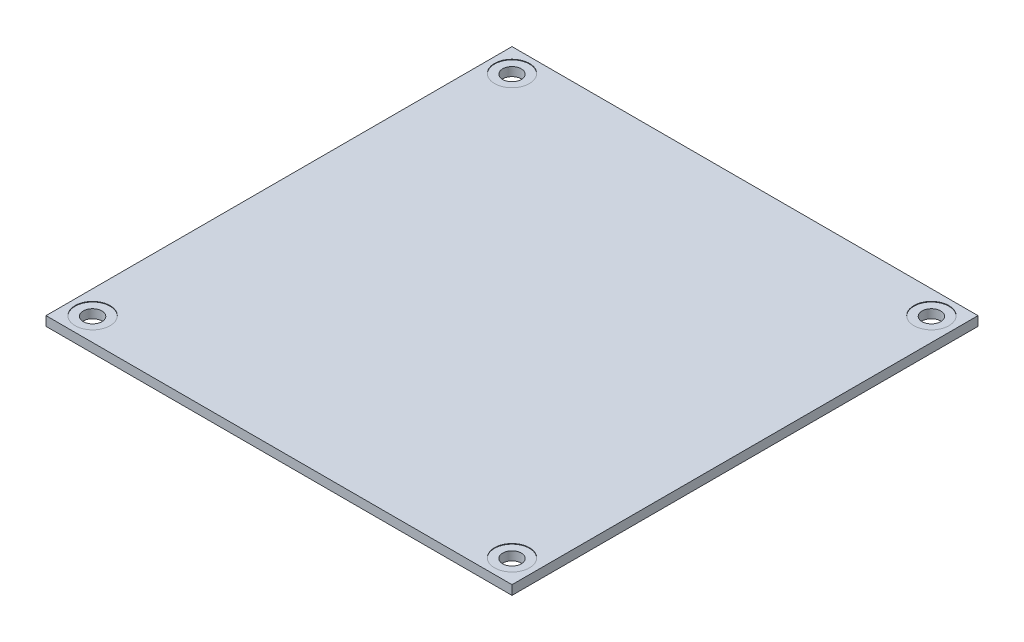
ISO-10303-21;
HEADER;
FILE_DESCRIPTION(('STEP AP214'),'2;1');
FILE_NAME('part.step','',(''),(''),'','','');
FILE_SCHEMA(('AUTOMOTIVE_DESIGN { 1 0 10303 214 1 1 1 1 }'));
ENDSEC;
DATA;
#1=APPLICATION_CONTEXT('core data for automotive mechanical design processes');
#2=APPLICATION_PROTOCOL_DEFINITION('international standard','automotive_design',2000,#1);
#3=PRODUCT_CONTEXT('',#1,'mechanical');
#4=PRODUCT('Part','Part','',(#3));
#5=PRODUCT_RELATED_PRODUCT_CATEGORY('part','',(#4));
#6=PRODUCT_DEFINITION_FORMATION('','',#4);
#7=PRODUCT_DEFINITION_CONTEXT('part definition',#1,'design');
#8=PRODUCT_DEFINITION('design','',#6,#7);
#9=PRODUCT_DEFINITION_SHAPE('','',#8);
#10=(LENGTH_UNIT() NAMED_UNIT(*) SI_UNIT(.MILLI.,.METRE.));
#11=(NAMED_UNIT(*) PLANE_ANGLE_UNIT() SI_UNIT($,.RADIAN.));
#12=(NAMED_UNIT(*) SI_UNIT($,.STERADIAN.) SOLID_ANGLE_UNIT());
#13=UNCERTAINTY_MEASURE_WITH_UNIT(LENGTH_MEASURE(1.E-05),#10,'distance_accuracy_value','');
#14=(GEOMETRIC_REPRESENTATION_CONTEXT(3) GLOBAL_UNCERTAINTY_ASSIGNED_CONTEXT((#13)) GLOBAL_UNIT_ASSIGNED_CONTEXT((#10,
#11,#12)) REPRESENTATION_CONTEXT('',''));
#15=CARTESIAN_POINT('',(0.,0.,0.));
#16=DIRECTION('',(0.,0.,1.));
#17=DIRECTION('',(1.,0.,0.));
#18=AXIS2_PLACEMENT_3D('',#15,#16,#17);
#19=CARTESIAN_POINT('',(-40.,1.6,-40.));
#20=DIRECTION('',(1.,0.,0.));
#21=DIRECTION('',(0.,0.,-1.));
#22=AXIS2_PLACEMENT_3D('',#19,#20,#21);
#23=PLANE('',#22);
#24=DIRECTION('',(0.,0.,1.));
#25=VECTOR('',#24,1.);
#26=CARTESIAN_POINT('',(-40.,0.,-40.));
#27=LINE('',#26,#25);
#28=CARTESIAN_POINT('',(-40.,0.,-40.));
#29=VERTEX_POINT('',#28);
#30=CARTESIAN_POINT('',(-40.,0.,40.));
#31=VERTEX_POINT('',#30);
#32=EDGE_CURVE('E98',#29,#31,#27,.T.);
#33=ORIENTED_EDGE('',*,*,#32,.T.);
#34=DIRECTION('',(0.,-1.,0.));
#35=VECTOR('',#34,1.);
#36=CARTESIAN_POINT('',(-40.,1.6,40.));
#37=LINE('',#36,#35);
#38=CARTESIAN_POINT('',(-40.,1.6,40.));
#39=VERTEX_POINT('',#38);
#40=EDGE_CURVE('E11',#39,#31,#37,.T.);
#41=ORIENTED_EDGE('',*,*,#40,.F.);
#42=DIRECTION('',(0.,0.,1.));
#43=VECTOR('',#42,1.);
#44=CARTESIAN_POINT('',(-40.,1.6,-40.));
#45=LINE('',#44,#43);
#46=CARTESIAN_POINT('',(-40.,1.6,-40.));
#47=VERTEX_POINT('',#46);
#48=EDGE_CURVE('E83',#47,#39,#45,.T.);
#49=ORIENTED_EDGE('',*,*,#48,.F.);
#50=DIRECTION('',(0.,-1.,0.));
#51=VECTOR('',#50,1.);
#52=CARTESIAN_POINT('',(-40.,1.6,-40.));
#53=LINE('',#52,#51);
#54=EDGE_CURVE('E50',#47,#29,#53,.T.);
#55=ORIENTED_EDGE('',*,*,#54,.T.);
#56=EDGE_LOOP('',(#33,#41,#49,#55));
#57=FACE_BOUND('',#56,.T.);
#58=ADVANCED_FACE('F32',(#57),#23,.F.);
#59=CARTESIAN_POINT('',(-40.,1.6,40.));
#60=DIRECTION('',(0.,0.,-1.));
#61=DIRECTION('',(-1.,0.,0.));
#62=AXIS2_PLACEMENT_3D('',#59,#60,#61);
#63=PLANE('',#62);
#64=DIRECTION('',(1.,0.,0.));
#65=VECTOR('',#64,1.);
#66=CARTESIAN_POINT('',(-40.,0.,40.));
#67=LINE('',#66,#65);
#68=CARTESIAN_POINT('',(40.,0.,40.));
#69=VERTEX_POINT('',#68);
#70=EDGE_CURVE('E88',#31,#69,#67,.T.);
#71=ORIENTED_EDGE('',*,*,#70,.T.);
#72=DIRECTION('',(0.,-1.,0.));
#73=VECTOR('',#72,1.);
#74=CARTESIAN_POINT('',(40.,1.6,40.));
#75=LINE('',#74,#73);
#76=CARTESIAN_POINT('',(40.,1.6,40.));
#77=VERTEX_POINT('',#76);
#78=EDGE_CURVE('E41',#77,#69,#75,.T.);
#79=ORIENTED_EDGE('',*,*,#78,.F.);
#80=DIRECTION('',(1.,0.,0.));
#81=VECTOR('',#80,1.);
#82=CARTESIAN_POINT('',(-40.,1.6,40.));
#83=LINE('',#82,#81);
#84=EDGE_CURVE('E75',#39,#77,#83,.T.);
#85=ORIENTED_EDGE('',*,*,#84,.F.);
#86=ORIENTED_EDGE('',*,*,#40,.T.);
#87=EDGE_LOOP('',(#71,#79,#85,#86));
#88=FACE_BOUND('',#87,.T.);
#89=ADVANCED_FACE('F87',(#88),#63,.F.);
#90=CARTESIAN_POINT('',(40.,1.6,-40.));
#91=DIRECTION('',(1.,0.,0.));
#92=DIRECTION('',(0.,0.,-1.));
#93=AXIS2_PLACEMENT_3D('',#90,#91,#92);
#94=PLANE('',#93);
#95=DIRECTION('',(0.,0.,1.));
#96=VECTOR('',#95,1.);
#97=CARTESIAN_POINT('',(40.,0.,-40.));
#98=LINE('',#97,#96);
#99=CARTESIAN_POINT('',(40.,0.,-40.));
#100=VERTEX_POINT('',#99);
#101=EDGE_CURVE('E102',#100,#69,#98,.T.);
#102=ORIENTED_EDGE('',*,*,#101,.F.);
#103=DIRECTION('',(0.,-1.,0.));
#104=VECTOR('',#103,1.);
#105=CARTESIAN_POINT('',(40.,1.6,-40.));
#106=LINE('',#105,#104);
#107=CARTESIAN_POINT('',(40.,1.6,-40.));
#108=VERTEX_POINT('',#107);
#109=EDGE_CURVE('E64',#108,#100,#106,.T.);
#110=ORIENTED_EDGE('',*,*,#109,.F.);
#111=DIRECTION('',(0.,0.,1.));
#112=VECTOR('',#111,1.);
#113=CARTESIAN_POINT('',(40.,1.6,-40.));
#114=LINE('',#113,#112);
#115=EDGE_CURVE('E82',#108,#77,#114,.T.);
#116=ORIENTED_EDGE('',*,*,#115,.T.);
#117=ORIENTED_EDGE('',*,*,#78,.T.);
#118=EDGE_LOOP('',(#102,#110,#116,#117));
#119=FACE_BOUND('',#118,.T.);
#120=ADVANCED_FACE('F92',(#119),#94,.T.);
#121=CARTESIAN_POINT('',(-40.,1.6,-40.));
#122=DIRECTION('',(0.,0.,-1.));
#123=DIRECTION('',(-1.,0.,0.));
#124=AXIS2_PLACEMENT_3D('',#121,#122,#123);
#125=PLANE('',#124);
#126=DIRECTION('',(1.,0.,0.));
#127=VECTOR('',#126,1.);
#128=CARTESIAN_POINT('',(-40.,0.,-40.));
#129=LINE('',#128,#127);
#130=EDGE_CURVE('E104',#29,#100,#129,.T.);
#131=ORIENTED_EDGE('',*,*,#130,.F.);
#132=ORIENTED_EDGE('',*,*,#54,.F.);
#133=DIRECTION('',(1.,0.,0.));
#134=VECTOR('',#133,1.);
#135=CARTESIAN_POINT('',(-40.,1.6,-40.));
#136=LINE('',#135,#134);
#137=EDGE_CURVE('E93',#47,#108,#136,.T.);
#138=ORIENTED_EDGE('',*,*,#137,.T.);
#139=ORIENTED_EDGE('',*,*,#109,.T.);
#140=EDGE_LOOP('',(#131,#132,#138,#139));
#141=FACE_BOUND('',#140,.T.);
#142=ADVANCED_FACE('F159',(#141),#125,.T.);
#143=CARTESIAN_POINT('',(0.,1.6,0.));
#144=DIRECTION('',(0.,1.,0.));
#145=DIRECTION('',(0.,0.,1.));
#146=AXIS2_PLACEMENT_3D('',#143,#144,#145);
#147=PLANE('',#146);
#148=CARTESIAN_POINT('',(36.,1.6,-36.));
#149=DIRECTION('',(0.,1.,0.));
#150=DIRECTION('',(0.,0.,-1.));
#151=AXIS2_PLACEMENT_3D('',#148,#149,#150);
#152=CIRCLE('',#151,3.);
#153=CARTESIAN_POINT('',(36.,1.6,-39.));
#154=VERTEX_POINT('',#153);
#155=EDGE_CURVE('E136',#154,#154,#152,.T.);
#156=ORIENTED_EDGE('',*,*,#155,.F.);
#157=EDGE_LOOP('',(#156));
#158=FACE_BOUND('',#157,.T.);
#159=CARTESIAN_POINT('',(36.,1.6,36.));
#160=DIRECTION('',(0.,1.,0.));
#161=DIRECTION('',(0.,0.,1.));
#162=AXIS2_PLACEMENT_3D('',#159,#160,#161);
#163=CIRCLE('',#162,3.);
#164=CARTESIAN_POINT('',(36.,1.6,39.));
#165=VERTEX_POINT('',#164);
#166=EDGE_CURVE('E142',#165,#165,#163,.T.);
#167=ORIENTED_EDGE('',*,*,#166,.F.);
#168=EDGE_LOOP('',(#167));
#169=FACE_BOUND('',#168,.T.);
#170=CARTESIAN_POINT('',(-36.,1.6,36.));
#171=DIRECTION('',(0.,1.,0.));
#172=DIRECTION('',(0.,0.,-1.));
#173=AXIS2_PLACEMENT_3D('',#170,#171,#172);
#174=CIRCLE('',#173,3.);
#175=CARTESIAN_POINT('',(-36.,1.6,33.));
#176=VERTEX_POINT('',#175);
#177=EDGE_CURVE('E112',#176,#176,#174,.T.);
#178=ORIENTED_EDGE('',*,*,#177,.F.);
#179=EDGE_LOOP('',(#178));
#180=FACE_BOUND('',#179,.T.);
#181=CARTESIAN_POINT('',(-36.,1.6,-36.));
#182=DIRECTION('',(0.,1.,0.));
#183=DIRECTION('',(0.,0.,1.));
#184=AXIS2_PLACEMENT_3D('',#181,#182,#183);
#185=CIRCLE('',#184,3.);
#186=CARTESIAN_POINT('',(-36.,1.6,-33.));
#187=VERTEX_POINT('',#186);
#188=EDGE_CURVE('E135',#187,#187,#185,.T.);
#189=ORIENTED_EDGE('',*,*,#188,.F.);
#190=EDGE_LOOP('',(#189));
#191=FACE_BOUND('',#190,.T.);
#192=ORIENTED_EDGE('',*,*,#48,.T.);
#193=ORIENTED_EDGE('',*,*,#84,.T.);
#194=ORIENTED_EDGE('',*,*,#115,.F.);
#195=ORIENTED_EDGE('',*,*,#137,.F.);
#196=EDGE_LOOP('',(#192,#193,#194,#195));
#197=FACE_BOUND('',#196,.T.);
#198=ADVANCED_FACE('F79',(#158,#169,#180,#191,#197),#147,.T.);
#199=CARTESIAN_POINT('',(0.,0.,0.));
#200=DIRECTION('',(0.,1.,0.));
#201=DIRECTION('',(0.,0.,1.));
#202=AXIS2_PLACEMENT_3D('',#199,#200,#201);
#203=PLANE('',#202);
#204=CARTESIAN_POINT('',(36.,0.,-36.000000000002));
#205=DIRECTION('',(0.,1.,0.));
#206=DIRECTION('',(0.,0.,1.));
#207=AXIS2_PLACEMENT_3D('',#204,#205,#206);
#208=CIRCLE('',#207,1.60000000000209);
#209=CARTESIAN_POINT('',(36.,0.,-34.3999999999999));
#210=VERTEX_POINT('',#209);
#211=EDGE_CURVE('E117',#210,#210,#208,.T.);
#212=ORIENTED_EDGE('',*,*,#211,.T.);
#213=EDGE_LOOP('',(#212));
#214=FACE_BOUND('',#213,.T.);
#215=CARTESIAN_POINT('',(36.000000000002,0.,35.999999999998));
#216=DIRECTION('',(0.,1.,0.));
#217=DIRECTION('',(0.,0.,1.));
#218=AXIS2_PLACEMENT_3D('',#215,#216,#217);
#219=CIRCLE('',#218,1.6);
#220=CARTESIAN_POINT('',(36.000000000002,0.,37.599999999998));
#221=VERTEX_POINT('',#220);
#222=EDGE_CURVE('E321',#221,#221,#219,.T.);
#223=ORIENTED_EDGE('',*,*,#222,.T.);
#224=EDGE_LOOP('',(#223));
#225=FACE_BOUND('',#224,.T.);
#226=CARTESIAN_POINT('',(-35.999999999998,0.,36.));
#227=DIRECTION('',(0.,1.,0.));
#228=DIRECTION('',(0.,0.,1.));
#229=AXIS2_PLACEMENT_3D('',#226,#227,#228);
#230=CIRCLE('',#229,1.6);
#231=CARTESIAN_POINT('',(-35.999999999998,0.,37.6));
#232=VERTEX_POINT('',#231);
#233=EDGE_CURVE('E130',#232,#232,#230,.T.);
#234=ORIENTED_EDGE('',*,*,#233,.T.);
#235=EDGE_LOOP('',(#234));
#236=FACE_BOUND('',#235,.T.);
#237=CARTESIAN_POINT('',(-36.,0.,-36.));
#238=DIRECTION('',(0.,1.,0.));
#239=DIRECTION('',(0.,0.,1.));
#240=AXIS2_PLACEMENT_3D('',#237,#238,#239);
#241=CIRCLE('',#240,1.6);
#242=CARTESIAN_POINT('',(-36.,0.,-34.4));
#243=VERTEX_POINT('',#242);
#244=EDGE_CURVE('E113',#243,#243,#241,.T.);
#245=ORIENTED_EDGE('',*,*,#244,.T.);
#246=EDGE_LOOP('',(#245));
#247=FACE_BOUND('',#246,.T.);
#248=ORIENTED_EDGE('',*,*,#32,.F.);
#249=ORIENTED_EDGE('',*,*,#130,.T.);
#250=ORIENTED_EDGE('',*,*,#101,.T.);
#251=ORIENTED_EDGE('',*,*,#70,.F.);
#252=EDGE_LOOP('',(#248,#249,#250,#251));
#253=FACE_BOUND('',#252,.T.);
#254=ADVANCED_FACE('F158',(#214,#225,#236,#247,#253),#203,.F.);
#255=CARTESIAN_POINT('',(-36.,1.5,-36.));
#256=DIRECTION('',(0.,1.,0.));
#257=DIRECTION('',(0.,0.,1.));
#258=AXIS2_PLACEMENT_3D('',#255,#256,#257);
#259=CYLINDRICAL_SURFACE('',#258,3.);
#260=CARTESIAN_POINT('',(-36.,1.5,-36.));
#261=DIRECTION('',(0.,1.,0.));
#262=DIRECTION('',(0.,0.,1.));
#263=AXIS2_PLACEMENT_3D('',#260,#261,#262);
#264=CIRCLE('',#263,3.);
#265=CARTESIAN_POINT('',(-36.,1.5,-33.));
#266=VERTEX_POINT('',#265);
#267=EDGE_CURVE('E100',#266,#266,#264,.T.);
#268=ORIENTED_EDGE('',*,*,#267,.F.);
#269=EDGE_LOOP('',(#268));
#270=FACE_BOUND('',#269,.T.);
#271=ORIENTED_EDGE('',*,*,#188,.T.);
#272=EDGE_LOOP('',(#271));
#273=FACE_BOUND('',#272,.T.);
#274=ADVANCED_FACE('F155',(#270,#273),#259,.F.);
#275=CARTESIAN_POINT('',(-36.,1.5,-36.));
#276=DIRECTION('',(0.,1.,0.));
#277=DIRECTION('',(0.,0.,1.));
#278=AXIS2_PLACEMENT_3D('',#275,#276,#277);
#279=PLANE('',#278);
#280=CARTESIAN_POINT('',(-36.,1.5,-36.));
#281=DIRECTION('',(0.,1.,0.));
#282=DIRECTION('',(0.,0.,1.));
#283=AXIS2_PLACEMENT_3D('',#280,#281,#282);
#284=CIRCLE('',#283,1.6);
#285=CARTESIAN_POINT('',(-36.,1.5,-34.4));
#286=VERTEX_POINT('',#285);
#287=EDGE_CURVE('E109',#286,#286,#284,.T.);
#288=ORIENTED_EDGE('',*,*,#287,.F.);
#289=EDGE_LOOP('',(#288));
#290=FACE_BOUND('',#289,.T.);
#291=ORIENTED_EDGE('',*,*,#267,.T.);
#292=EDGE_LOOP('',(#291));
#293=FACE_BOUND('',#292,.T.);
#294=ADVANCED_FACE('F201',(#290,#293),#279,.T.);
#295=CARTESIAN_POINT('',(-36.,1.5,36.));
#296=DIRECTION('',(0.,1.,0.));
#297=DIRECTION('',(0.,0.,1.));
#298=AXIS2_PLACEMENT_3D('',#295,#296,#297);
#299=CYLINDRICAL_SURFACE('',#298,3.);
#300=CARTESIAN_POINT('',(-36.,1.5,36.));
#301=DIRECTION('',(0.,1.,0.));
#302=DIRECTION('',(0.,0.,-1.));
#303=AXIS2_PLACEMENT_3D('',#300,#301,#302);
#304=CIRCLE('',#303,3.);
#305=CARTESIAN_POINT('',(-36.,1.5,33.));
#306=VERTEX_POINT('',#305);
#307=EDGE_CURVE('E145',#306,#306,#304,.T.);
#308=ORIENTED_EDGE('',*,*,#307,.F.);
#309=EDGE_LOOP('',(#308));
#310=FACE_BOUND('',#309,.T.);
#311=ORIENTED_EDGE('',*,*,#177,.T.);
#312=EDGE_LOOP('',(#311));
#313=FACE_BOUND('',#312,.T.);
#314=ADVANCED_FACE('F208',(#310,#313),#299,.F.);
#315=CARTESIAN_POINT('',(-36.,1.5,36.));
#316=DIRECTION('',(0.,-1.,0.));
#317=DIRECTION('',(0.,0.,-1.));
#318=AXIS2_PLACEMENT_3D('',#315,#316,#317);
#319=PLANE('',#318);
#320=CARTESIAN_POINT('',(-35.999999999998,1.5,36.));
#321=DIRECTION('',(0.,-1.,0.));
#322=DIRECTION('',(0.,0.,-1.));
#323=AXIS2_PLACEMENT_3D('',#320,#321,#322);
#324=CIRCLE('',#323,1.6);
#325=CARTESIAN_POINT('',(-35.999999999998,1.5,34.4));
#326=VERTEX_POINT('',#325);
#327=EDGE_CURVE('E35',#326,#326,#324,.T.);
#328=ORIENTED_EDGE('',*,*,#327,.T.);
#329=EDGE_LOOP('',(#328));
#330=FACE_BOUND('',#329,.T.);
#331=ORIENTED_EDGE('',*,*,#307,.T.);
#332=EDGE_LOOP('',(#331));
#333=FACE_BOUND('',#332,.T.);
#334=ADVANCED_FACE('F213',(#330,#333),#319,.F.);
#335=CARTESIAN_POINT('',(36.,1.5,36.));
#336=DIRECTION('',(0.,1.,0.));
#337=DIRECTION('',(0.,0.,1.));
#338=AXIS2_PLACEMENT_3D('',#335,#336,#337);
#339=CYLINDRICAL_SURFACE('',#338,3.);
#340=CARTESIAN_POINT('',(36.,1.5,36.));
#341=DIRECTION('',(0.,1.,0.));
#342=DIRECTION('',(0.,0.,1.));
#343=AXIS2_PLACEMENT_3D('',#340,#341,#342);
#344=CIRCLE('',#343,3.);
#345=CARTESIAN_POINT('',(36.,1.5,39.));
#346=VERTEX_POINT('',#345);
#347=EDGE_CURVE('E139',#346,#346,#344,.T.);
#348=ORIENTED_EDGE('',*,*,#347,.F.);
#349=EDGE_LOOP('',(#348));
#350=FACE_BOUND('',#349,.T.);
#351=ORIENTED_EDGE('',*,*,#166,.T.);
#352=EDGE_LOOP('',(#351));
#353=FACE_BOUND('',#352,.T.);
#354=ADVANCED_FACE('F221',(#350,#353),#339,.F.);
#355=CARTESIAN_POINT('',(36.,1.5,36.));
#356=DIRECTION('',(0.,1.,0.));
#357=DIRECTION('',(0.,0.,1.));
#358=AXIS2_PLACEMENT_3D('',#355,#356,#357);
#359=PLANE('',#358);
#360=CARTESIAN_POINT('',(36.000000000002,1.5,35.999999999998));
#361=DIRECTION('',(0.,1.,0.));
#362=DIRECTION('',(0.,0.,1.));
#363=AXIS2_PLACEMENT_3D('',#360,#361,#362);
#364=CIRCLE('',#363,1.6);
#365=CARTESIAN_POINT('',(36.000000000002,1.5,37.599999999998));
#366=VERTEX_POINT('',#365);
#367=EDGE_CURVE('E116',#366,#366,#364,.T.);
#368=ORIENTED_EDGE('',*,*,#367,.F.);
#369=EDGE_LOOP('',(#368));
#370=FACE_BOUND('',#369,.T.);
#371=ORIENTED_EDGE('',*,*,#347,.T.);
#372=EDGE_LOOP('',(#371));
#373=FACE_BOUND('',#372,.T.);
#374=ADVANCED_FACE('F226',(#370,#373),#359,.T.);
#375=CARTESIAN_POINT('',(36.,1.5,-36.));
#376=DIRECTION('',(0.,1.,0.));
#377=DIRECTION('',(0.,0.,1.));
#378=AXIS2_PLACEMENT_3D('',#375,#376,#377);
#379=CYLINDRICAL_SURFACE('',#378,3.);
#380=CARTESIAN_POINT('',(36.,1.5,-36.));
#381=DIRECTION('',(0.,1.,0.));
#382=DIRECTION('',(0.,0.,-1.));
#383=AXIS2_PLACEMENT_3D('',#380,#381,#382);
#384=CIRCLE('',#383,3.);
#385=CARTESIAN_POINT('',(36.,1.5,-39.));
#386=VERTEX_POINT('',#385);
#387=EDGE_CURVE('E132',#386,#386,#384,.T.);
#388=ORIENTED_EDGE('',*,*,#387,.F.);
#389=EDGE_LOOP('',(#388));
#390=FACE_BOUND('',#389,.T.);
#391=ORIENTED_EDGE('',*,*,#155,.T.);
#392=EDGE_LOOP('',(#391));
#393=FACE_BOUND('',#392,.T.);
#394=ADVANCED_FACE('F234',(#390,#393),#379,.F.);
#395=CARTESIAN_POINT('',(36.,1.5,-36.));
#396=DIRECTION('',(0.,-1.,0.));
#397=DIRECTION('',(0.,0.,-1.));
#398=AXIS2_PLACEMENT_3D('',#395,#396,#397);
#399=PLANE('',#398);
#400=CARTESIAN_POINT('',(36.,1.5,-36.000000000002));
#401=DIRECTION('',(0.,-1.,0.));
#402=DIRECTION('',(0.,0.,-1.));
#403=AXIS2_PLACEMENT_3D('',#400,#401,#402);
#404=CIRCLE('',#403,1.60000000000209);
#405=CARTESIAN_POINT('',(36.,1.5,-37.6000000000041));
#406=VERTEX_POINT('',#405);
#407=EDGE_CURVE('E114',#406,#406,#404,.T.);
#408=ORIENTED_EDGE('',*,*,#407,.T.);
#409=EDGE_LOOP('',(#408));
#410=FACE_BOUND('',#409,.T.);
#411=ORIENTED_EDGE('',*,*,#387,.T.);
#412=EDGE_LOOP('',(#411));
#413=FACE_BOUND('',#412,.T.);
#414=ADVANCED_FACE('F239',(#410,#413),#399,.F.);
#415=CARTESIAN_POINT('',(-36.,0.,-36.));
#416=DIRECTION('',(0.,1.,0.));
#417=DIRECTION('',(0.,0.,1.));
#418=AXIS2_PLACEMENT_3D('',#415,#416,#417);
#419=CYLINDRICAL_SURFACE('',#418,1.6);
#420=ORIENTED_EDGE('',*,*,#287,.T.);
#421=EDGE_LOOP('',(#420));
#422=FACE_BOUND('',#421,.T.);
#423=ORIENTED_EDGE('',*,*,#244,.F.);
#424=EDGE_LOOP('',(#423));
#425=FACE_BOUND('',#424,.T.);
#426=ADVANCED_FACE('F274',(#422,#425),#419,.F.);
#427=CARTESIAN_POINT('',(36.,0.,-36.000000000002));
#428=DIRECTION('',(0.,1.,0.));
#429=DIRECTION('',(0.,0.,1.));
#430=AXIS2_PLACEMENT_3D('',#427,#428,#429);
#431=CYLINDRICAL_SURFACE('',#430,1.60000000000209);
#432=ORIENTED_EDGE('',*,*,#211,.F.);
#433=EDGE_LOOP('',(#432));
#434=FACE_BOUND('',#433,.T.);
#435=ORIENTED_EDGE('',*,*,#407,.F.);
#436=EDGE_LOOP('',(#435));
#437=FACE_BOUND('',#436,.T.);
#438=ADVANCED_FACE('F284',(#434,#437),#431,.F.);
#439=CARTESIAN_POINT('',(36.000000000002,0.,35.999999999998));
#440=DIRECTION('',(0.,1.,0.));
#441=DIRECTION('',(0.,0.,1.));
#442=AXIS2_PLACEMENT_3D('',#439,#440,#441);
#443=CYLINDRICAL_SURFACE('',#442,1.6);
#444=ORIENTED_EDGE('',*,*,#367,.T.);
#445=EDGE_LOOP('',(#444));
#446=FACE_BOUND('',#445,.T.);
#447=ORIENTED_EDGE('',*,*,#222,.F.);
#448=EDGE_LOOP('',(#447));
#449=FACE_BOUND('',#448,.T.);
#450=ADVANCED_FACE('F294',(#446,#449),#443,.F.);
#451=CARTESIAN_POINT('',(-35.999999999998,0.,36.));
#452=DIRECTION('',(0.,1.,0.));
#453=DIRECTION('',(0.,0.,1.));
#454=AXIS2_PLACEMENT_3D('',#451,#452,#453);
#455=CYLINDRICAL_SURFACE('',#454,1.6);
#456=ORIENTED_EDGE('',*,*,#233,.F.);
#457=EDGE_LOOP('',(#456));
#458=FACE_BOUND('',#457,.T.);
#459=ORIENTED_EDGE('',*,*,#327,.F.);
#460=EDGE_LOOP('',(#459));
#461=FACE_BOUND('',#460,.T.);
#462=ADVANCED_FACE('F304',(#458,#461),#455,.F.);
#463=CLOSED_SHELL('',(#58,#89,#120,#142,#198,#254,#274,#294,#314,#334,#354,#374,#394,#414,#426,
#438,#450,#462));
#464=MANIFOLD_SOLID_BREP('B2',#463);
#465=ADVANCED_BREP_SHAPE_REPRESENTATION('',(#18,#464),#14);
#466=SHAPE_DEFINITION_REPRESENTATION(#9,#465);
ENDSEC;
END-ISO-10303-21;
